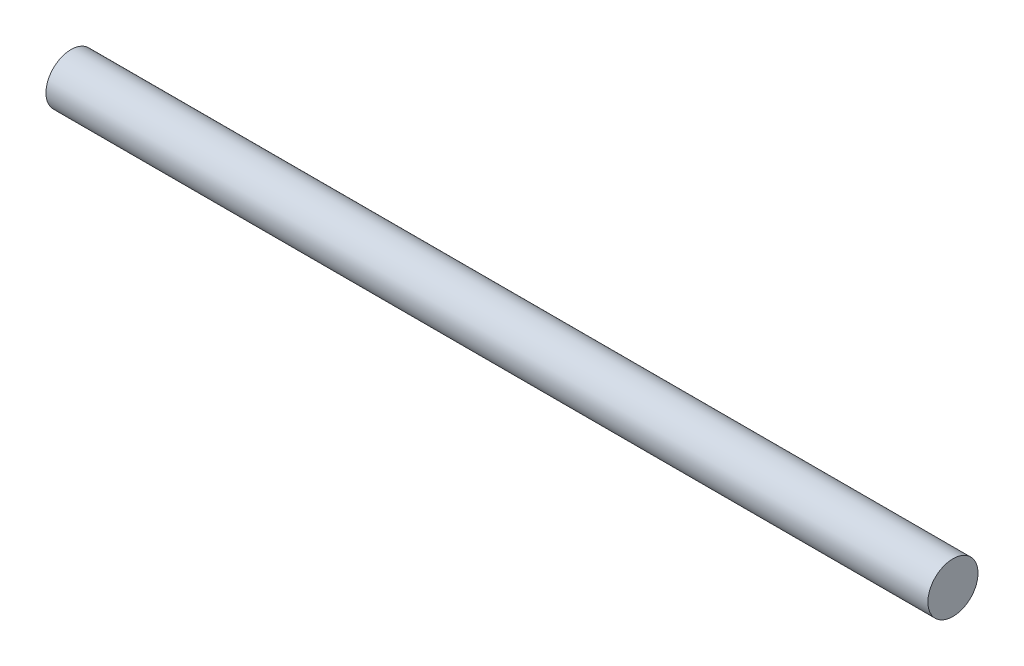
ISO-10303-21;
HEADER;
FILE_DESCRIPTION(('STEP AP214'),'2;1');
FILE_NAME('part.step','',(''),(''),'','','');
FILE_SCHEMA(('AUTOMOTIVE_DESIGN { 1 0 10303 214 1 1 1 1 }'));
ENDSEC;
DATA;
#1=APPLICATION_CONTEXT('core data for automotive mechanical design processes');
#2=APPLICATION_PROTOCOL_DEFINITION('international standard','automotive_design',2000,#1);
#3=PRODUCT_CONTEXT('',#1,'mechanical');
#4=PRODUCT('Part','Part','',(#3));
#5=PRODUCT_RELATED_PRODUCT_CATEGORY('part','',(#4));
#6=PRODUCT_DEFINITION_FORMATION('','',#4);
#7=PRODUCT_DEFINITION_CONTEXT('part definition',#1,'design');
#8=PRODUCT_DEFINITION('design','',#6,#7);
#9=PRODUCT_DEFINITION_SHAPE('','',#8);
#10=(LENGTH_UNIT() NAMED_UNIT(*) SI_UNIT(.MILLI.,.METRE.));
#11=(NAMED_UNIT(*) PLANE_ANGLE_UNIT() SI_UNIT($,.RADIAN.));
#12=(NAMED_UNIT(*) SI_UNIT($,.STERADIAN.) SOLID_ANGLE_UNIT());
#13=UNCERTAINTY_MEASURE_WITH_UNIT(LENGTH_MEASURE(1.E-05),#10,'distance_accuracy_value','');
#14=(GEOMETRIC_REPRESENTATION_CONTEXT(3) GLOBAL_UNCERTAINTY_ASSIGNED_CONTEXT((#13)) GLOBAL_UNIT_ASSIGNED_CONTEXT((#10,
#11,#12)) REPRESENTATION_CONTEXT('',''));
#15=CARTESIAN_POINT('',(0.,0.,0.));
#16=DIRECTION('',(0.,0.,1.));
#17=DIRECTION('',(1.,0.,0.));
#18=AXIS2_PLACEMENT_3D('',#15,#16,#17);
#19=CARTESIAN_POINT('',(88.,0.,0.));
#20=DIRECTION('',(-1.,0.,0.));
#21=DIRECTION('',(0.,0.,1.));
#22=AXIS2_PLACEMENT_3D('',#19,#20,#21);
#23=CYLINDRICAL_SURFACE('',#22,4.99999999999989);
#24=CARTESIAN_POINT('',(88.,0.,0.));
#25=DIRECTION('',(1.,0.,0.));
#26=DIRECTION('',(0.,0.,-1.));
#27=AXIS2_PLACEMENT_3D('',#24,#25,#26);
#28=CIRCLE('',#27,4.99999999999989);
#29=CARTESIAN_POINT('',(88.,0.,-4.99999999999989));
#30=VERTEX_POINT('',#29);
#31=EDGE_CURVE('E10',#30,#30,#28,.T.);
#32=ORIENTED_EDGE('',*,*,#31,.F.);
#33=EDGE_LOOP('',(#32));
#34=FACE_BOUND('',#33,.T.);
#35=CARTESIAN_POINT('',(-88.,0.,0.));
#36=DIRECTION('',(1.,0.,0.));
#37=DIRECTION('',(0.,0.,-1.));
#38=AXIS2_PLACEMENT_3D('',#35,#36,#37);
#39=CIRCLE('',#38,4.99999999999989);
#40=CARTESIAN_POINT('',(-88.,0.,-4.99999999999989));
#41=VERTEX_POINT('',#40);
#42=EDGE_CURVE('E38',#41,#41,#39,.T.);
#43=ORIENTED_EDGE('',*,*,#42,.T.);
#44=EDGE_LOOP('',(#43));
#45=FACE_BOUND('',#44,.T.);
#46=ADVANCED_FACE('F35',(#34,#45),#23,.T.);
#47=CARTESIAN_POINT('',(88.,0.,0.));
#48=DIRECTION('',(1.,0.,0.));
#49=DIRECTION('',(0.,0.,-1.));
#50=AXIS2_PLACEMENT_3D('',#47,#48,#49);
#51=PLANE('',#50);
#52=ORIENTED_EDGE('',*,*,#31,.T.);
#53=EDGE_LOOP('',(#52));
#54=FACE_BOUND('',#53,.T.);
#55=ADVANCED_FACE('F50',(#54),#51,.T.);
#56=CARTESIAN_POINT('',(-88.,0.,0.));
#57=DIRECTION('',(1.,0.,0.));
#58=DIRECTION('',(0.,0.,-1.));
#59=AXIS2_PLACEMENT_3D('',#56,#57,#58);
#60=PLANE('',#59);
#61=ORIENTED_EDGE('',*,*,#42,.F.);
#62=EDGE_LOOP('',(#61));
#63=FACE_BOUND('',#62,.T.);
#64=ADVANCED_FACE('F48',(#63),#60,.F.);
#65=CLOSED_SHELL('',(#46,#55,#64));
#66=MANIFOLD_SOLID_BREP('B2',#65);
#67=ADVANCED_BREP_SHAPE_REPRESENTATION('',(#18,#66),#14);
#68=SHAPE_DEFINITION_REPRESENTATION(#9,#67);
ENDSEC;
END-ISO-10303-21;
